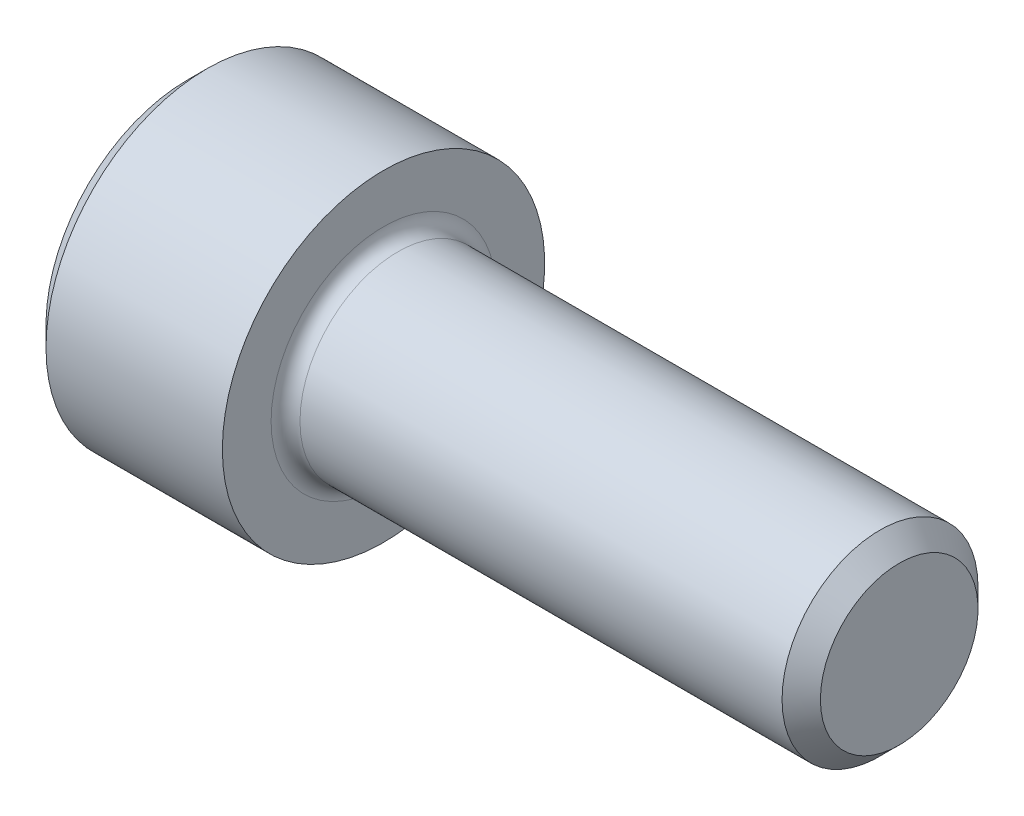
ISO-10303-21;
HEADER;
FILE_DESCRIPTION(('STEP AP214'),'2;1');
FILE_NAME('part.step','',(''),(''),'','','');
FILE_SCHEMA(('AUTOMOTIVE_DESIGN { 1 0 10303 214 1 1 1 1 }'));
ENDSEC;
DATA;
#1=APPLICATION_CONTEXT('core data for automotive mechanical design processes');
#2=APPLICATION_PROTOCOL_DEFINITION('international standard','automotive_design',2000,#1);
#3=PRODUCT_CONTEXT('',#1,'mechanical');
#4=PRODUCT('Part','Part','',(#3));
#5=PRODUCT_RELATED_PRODUCT_CATEGORY('part','',(#4));
#6=PRODUCT_DEFINITION_FORMATION('','',#4);
#7=PRODUCT_DEFINITION_CONTEXT('part definition',#1,'design');
#8=PRODUCT_DEFINITION('design','',#6,#7);
#9=PRODUCT_DEFINITION_SHAPE('','',#8);
#10=(LENGTH_UNIT() NAMED_UNIT(*) SI_UNIT(.MILLI.,.METRE.));
#11=(NAMED_UNIT(*) PLANE_ANGLE_UNIT() SI_UNIT($,.RADIAN.));
#12=(NAMED_UNIT(*) SI_UNIT($,.STERADIAN.) SOLID_ANGLE_UNIT());
#13=UNCERTAINTY_MEASURE_WITH_UNIT(LENGTH_MEASURE(1.E-05),#10,'distance_accuracy_value','');
#14=(GEOMETRIC_REPRESENTATION_CONTEXT(3) GLOBAL_UNCERTAINTY_ASSIGNED_CONTEXT((#13)) GLOBAL_UNIT_ASSIGNED_CONTEXT((#10,
#11,#12)) REPRESENTATION_CONTEXT('',''));
#15=CARTESIAN_POINT('',(0.,0.,0.));
#16=DIRECTION('',(0.,0.,1.));
#17=DIRECTION('',(1.,0.,0.));
#18=AXIS2_PLACEMENT_3D('',#15,#16,#17);
#19=CARTESIAN_POINT('',(2.286,1.14604605784411,1.98501));
#20=DIRECTION('',(-1.,0.,0.));
#21=DIRECTION('',(0.,0.,1.));
#22=AXIS2_PLACEMENT_3D('',#19,#20,#21);
#23=PLANE('',#22);
#24=DIRECTION('',(0.,0.500000000000001,0.866025403784438));
#25=VECTOR('',#24,1.);
#26=CARTESIAN_POINT('',(2.286,-1.71906908676614,0.992505));
#27=LINE('',#26,#25);
#28=CARTESIAN_POINT('',(2.2859999999804,-1.71906908679011,0.992505000013839));
#29=VERTEX_POINT('',#28);
#30=CARTESIAN_POINT('',(2.286,-1.14604605784409,1.98501));
#31=VERTEX_POINT('',#30);
#32=EDGE_CURVE('E123',#29,#31,#27,.T.);
#33=ORIENTED_EDGE('',*,*,#32,.T.);
#34=DIRECTION('',(0.,1.,0.));
#35=VECTOR('',#34,1.);
#36=CARTESIAN_POINT('',(2.286,1.14604605784411,1.98501));
#37=LINE('',#36,#35);
#38=CARTESIAN_POINT('',(2.28599999998701,0.,1.98501000001309));
#39=VERTEX_POINT('',#38);
#40=EDGE_CURVE('E118',#31,#39,#37,.T.);
#41=ORIENTED_EDGE('',*,*,#40,.T.);
#42=CARTESIAN_POINT('',(2.2859999999608,0.,0.));
#43=DIRECTION('',(-1.,0.,0.));
#44=DIRECTION('',(0.,0.,1.));
#45=AXIS2_PLACEMENT_3D('',#42,#43,#44);
#46=CIRCLE('',#45,1.98501000005535);
#47=EDGE_CURVE('E120',#39,#29,#46,.F.);
#48=ORIENTED_EDGE('',*,*,#47,.T.);
#49=EDGE_LOOP('',(#33,#41,#48));
#50=FACE_BOUND('',#49,.T.);
#51=ADVANCED_FACE('F16',(#50),#23,.T.);
#52=CARTESIAN_POINT('',(2.286,1.14604605784411,1.98501));
#53=DIRECTION('',(-1.,0.,0.));
#54=DIRECTION('',(0.,0.,1.));
#55=AXIS2_PLACEMENT_3D('',#52,#53,#54);
#56=PLANE('',#55);
#57=DIRECTION('',(0.,-0.499999999999998,0.86602540378444));
#58=VECTOR('',#57,1.);
#59=CARTESIAN_POINT('',(2.286,-1.71906908676615,-0.992504999999996));
#60=LINE('',#59,#58);
#61=CARTESIAN_POINT('',(2.2859999999804,-1.71906908679012,-0.992505000013836));
#62=VERTEX_POINT('',#61);
#63=CARTESIAN_POINT('',(2.286,-2.29209211568819,0.));
#64=VERTEX_POINT('',#63);
#65=EDGE_CURVE('E128',#62,#64,#60,.T.);
#66=ORIENTED_EDGE('',*,*,#65,.T.);
#67=DIRECTION('',(0.,0.500000000000001,0.866025403784438));
#68=VECTOR('',#67,1.);
#69=CARTESIAN_POINT('',(2.286,-2.29209211568819,0.));
#70=LINE('',#69,#68);
#71=EDGE_CURVE('E191',#64,#29,#70,.T.);
#72=ORIENTED_EDGE('',*,*,#71,.T.);
#73=CARTESIAN_POINT('',(2.2859999999608,0.,0.));
#74=DIRECTION('',(-1.,0.,0.));
#75=DIRECTION('',(0.,0.,1.));
#76=AXIS2_PLACEMENT_3D('',#73,#74,#75);
#77=CIRCLE('',#76,1.98501000005535);
#78=EDGE_CURVE('E140',#29,#62,#77,.F.);
#79=ORIENTED_EDGE('',*,*,#78,.T.);
#80=EDGE_LOOP('',(#66,#72,#79));
#81=FACE_BOUND('',#80,.T.);
#82=ADVANCED_FACE('F367',(#81),#56,.T.);
#83=CARTESIAN_POINT('',(2.286,1.14604605784411,1.98501));
#84=DIRECTION('',(-1.,0.,0.));
#85=DIRECTION('',(0.,0.,1.));
#86=AXIS2_PLACEMENT_3D('',#83,#84,#85);
#87=PLANE('',#86);
#88=DIRECTION('',(0.,1.,0.));
#89=VECTOR('',#88,1.);
#90=CARTESIAN_POINT('',(2.286,1.14604605784411,-1.98501));
#91=LINE('',#90,#89);
#92=CARTESIAN_POINT('',(2.28599999998701,0.,-1.98501000001309));
#93=VERTEX_POINT('',#92);
#94=CARTESIAN_POINT('',(2.286,-1.1460460578441,-1.98501));
#95=VERTEX_POINT('',#94);
#96=EDGE_CURVE('E187',#93,#95,#91,.F.);
#97=ORIENTED_EDGE('',*,*,#96,.T.);
#98=DIRECTION('',(0.,-0.499999999999999,0.866025403784439));
#99=VECTOR('',#98,1.);
#100=CARTESIAN_POINT('',(2.286,-1.1460460578441,-1.98501));
#101=LINE('',#100,#99);
#102=EDGE_CURVE('E183',#95,#62,#101,.T.);
#103=ORIENTED_EDGE('',*,*,#102,.T.);
#104=CARTESIAN_POINT('',(2.2859999999608,0.,0.));
#105=DIRECTION('',(-1.,0.,0.));
#106=DIRECTION('',(0.,0.,1.));
#107=AXIS2_PLACEMENT_3D('',#104,#105,#106);
#108=CIRCLE('',#107,1.98501000005535);
#109=EDGE_CURVE('E237',#62,#93,#108,.F.);
#110=ORIENTED_EDGE('',*,*,#109,.T.);
#111=EDGE_LOOP('',(#97,#103,#110));
#112=FACE_BOUND('',#111,.T.);
#113=ADVANCED_FACE('F364',(#112),#87,.T.);
#114=CARTESIAN_POINT('',(2.286,1.14604605784411,1.98501));
#115=DIRECTION('',(-1.,0.,0.));
#116=DIRECTION('',(0.,0.,1.));
#117=AXIS2_PLACEMENT_3D('',#114,#115,#116);
#118=PLANE('',#117);
#119=DIRECTION('',(0.,-0.500000000000001,-0.866025403784438));
#120=VECTOR('',#119,1.);
#121=CARTESIAN_POINT('',(2.286,1.71906908676615,-0.992505000000006));
#122=LINE('',#121,#120);
#123=CARTESIAN_POINT('',(2.2859999999804,1.71906908679012,-0.992505000013843));
#124=VERTEX_POINT('',#123);
#125=CARTESIAN_POINT('',(2.286,1.1460460578441,-1.98501));
#126=VERTEX_POINT('',#125);
#127=EDGE_CURVE('E180',#124,#126,#122,.T.);
#128=ORIENTED_EDGE('',*,*,#127,.T.);
#129=DIRECTION('',(0.,1.,0.));
#130=VECTOR('',#129,1.);
#131=CARTESIAN_POINT('',(2.286,1.14604605784411,-1.98501));
#132=LINE('',#131,#130);
#133=EDGE_CURVE('E176',#126,#93,#132,.F.);
#134=ORIENTED_EDGE('',*,*,#133,.T.);
#135=CARTESIAN_POINT('',(2.2859999999608,0.,0.));
#136=DIRECTION('',(-1.,0.,0.));
#137=DIRECTION('',(0.,0.,1.));
#138=AXIS2_PLACEMENT_3D('',#135,#136,#137);
#139=CIRCLE('',#138,1.98501000005535);
#140=EDGE_CURVE('E233',#93,#124,#139,.F.);
#141=ORIENTED_EDGE('',*,*,#140,.T.);
#142=EDGE_LOOP('',(#128,#134,#141));
#143=FACE_BOUND('',#142,.T.);
#144=ADVANCED_FACE('F360',(#143),#118,.T.);
#145=CARTESIAN_POINT('',(2.286,1.14604605784411,1.98501));
#146=DIRECTION('',(-1.,0.,0.));
#147=DIRECTION('',(0.,0.,1.));
#148=AXIS2_PLACEMENT_3D('',#145,#146,#147);
#149=PLANE('',#148);
#150=DIRECTION('',(0.,0.500000000000002,-0.866025403784437));
#151=VECTOR('',#150,1.);
#152=CARTESIAN_POINT('',(2.286,1.71906908676615,0.992504999999996));
#153=LINE('',#152,#151);
#154=CARTESIAN_POINT('',(2.2859999999804,1.71906908679012,0.992505000013835));
#155=VERTEX_POINT('',#154);
#156=CARTESIAN_POINT('',(2.286,2.2920921156882,0.));
#157=VERTEX_POINT('',#156);
#158=EDGE_CURVE('E172',#155,#157,#153,.T.);
#159=ORIENTED_EDGE('',*,*,#158,.T.);
#160=DIRECTION('',(0.,-0.500000000000002,-0.866025403784437));
#161=VECTOR('',#160,1.);
#162=CARTESIAN_POINT('',(2.286,2.2920921156882,0.));
#163=LINE('',#162,#161);
#164=EDGE_CURVE('E142',#157,#124,#163,.T.);
#165=ORIENTED_EDGE('',*,*,#164,.T.);
#166=CARTESIAN_POINT('',(2.2859999999608,0.,0.));
#167=DIRECTION('',(-1.,0.,0.));
#168=DIRECTION('',(0.,0.,1.));
#169=AXIS2_PLACEMENT_3D('',#166,#167,#168);
#170=CIRCLE('',#169,1.98501000005535);
#171=EDGE_CURVE('E150',#124,#155,#170,.F.);
#172=ORIENTED_EDGE('',*,*,#171,.T.);
#173=EDGE_LOOP('',(#159,#165,#172));
#174=FACE_BOUND('',#173,.T.);
#175=ADVANCED_FACE('F356',(#174),#149,.T.);
#176=CARTESIAN_POINT('',(2.28600000002643,0.,0.));
#177=DIRECTION('',(-1.,0.,0.));
#178=DIRECTION('',(0.,0.,1.));
#179=AXIS2_PLACEMENT_3D('',#176,#177,#178);
#180=CONICAL_SURFACE('',#179,1.98500999994167,1.04719755112655);
#181=CARTESIAN_POINT('',(3.43204605781011,0.,5.6843418860808E-11));
#182=VERTEX_POINT('',#181);
#183=VERTEX_LOOP('',#182);
#184=FACE_BOUND('',#183,.T.);
#185=ORIENTED_EDGE('',*,*,#47,.F.);
#186=CARTESIAN_POINT('',(2.2859999999608,0.,0.));
#187=DIRECTION('',(-1.,0.,0.));
#188=DIRECTION('',(0.,0.,1.));
#189=AXIS2_PLACEMENT_3D('',#186,#187,#188);
#190=CIRCLE('',#189,1.98501000005535);
#191=EDGE_CURVE('E136',#155,#39,#190,.F.);
#192=ORIENTED_EDGE('',*,*,#191,.F.);
#193=ORIENTED_EDGE('',*,*,#171,.F.);
#194=ORIENTED_EDGE('',*,*,#140,.F.);
#195=ORIENTED_EDGE('',*,*,#109,.F.);
#196=ORIENTED_EDGE('',*,*,#78,.F.);
#197=EDGE_LOOP('',(#185,#192,#193,#194,#195,#196));
#198=FACE_BOUND('',#197,.T.);
#199=ADVANCED_FACE('F134',(#184,#198),#180,.F.);
#200=CARTESIAN_POINT('',(2.286,1.14604605784411,1.98501));
#201=DIRECTION('',(-1.,0.,0.));
#202=DIRECTION('',(0.,0.,1.));
#203=AXIS2_PLACEMENT_3D('',#200,#201,#202);
#204=PLANE('',#203);
#205=DIRECTION('',(0.,-1.,0.));
#206=VECTOR('',#205,1.);
#207=CARTESIAN_POINT('',(2.286,-1.14604605784409,1.98501));
#208=LINE('',#207,#206);
#209=CARTESIAN_POINT('',(2.286,1.14604605784411,1.98501));
#210=VERTEX_POINT('',#209);
#211=EDGE_CURVE('E146',#39,#210,#208,.F.);
#212=ORIENTED_EDGE('',*,*,#211,.T.);
#213=DIRECTION('',(0.,0.499999999999998,-0.86602540378444));
#214=VECTOR('',#213,1.);
#215=CARTESIAN_POINT('',(2.286,2.2920921156882,0.));
#216=LINE('',#215,#214);
#217=EDGE_CURVE('E148',#155,#210,#216,.F.);
#218=ORIENTED_EDGE('',*,*,#217,.F.);
#219=ORIENTED_EDGE('',*,*,#191,.T.);
#220=EDGE_LOOP('',(#212,#218,#219));
#221=FACE_BOUND('',#220,.T.);
#222=ADVANCED_FACE('F145',(#221),#204,.T.);
#223=CARTESIAN_POINT('',(2.286,2.2920921156882,0.));
#224=DIRECTION('',(0.,-0.86602540378444,-0.499999999999998));
#225=DIRECTION('',(0.,0.499999999999998,-0.86602540378444));
#226=AXIS2_PLACEMENT_3D('',#223,#224,#225);
#227=PLANE('',#226);
#228=ORIENTED_EDGE('',*,*,#217,.T.);
#229=DIRECTION('',(1.,0.,0.));
#230=VECTOR('',#229,1.);
#231=CARTESIAN_POINT('',(2.286,1.14604605784411,1.98501));
#232=LINE('',#231,#230);
#233=CARTESIAN_POINT('',(0.,1.14604605784411,1.98501));
#234=VERTEX_POINT('',#233);
#235=EDGE_CURVE('E155',#210,#234,#232,.F.);
#236=ORIENTED_EDGE('',*,*,#235,.T.);
#237=DIRECTION('',(0.,-0.499999999999998,0.86602540378444));
#238=VECTOR('',#237,1.);
#239=CARTESIAN_POINT('',(0.,2.2920921156882,0.));
#240=LINE('',#239,#238);
#241=CARTESIAN_POINT('',(0.,2.2920921156882,0.));
#242=VERTEX_POINT('',#241);
#243=EDGE_CURVE('E166',#242,#234,#240,.T.);
#244=ORIENTED_EDGE('',*,*,#243,.F.);
#245=DIRECTION('',(1.,0.,0.));
#246=VECTOR('',#245,1.);
#247=CARTESIAN_POINT('',(2.286,2.2920921156882,0.));
#248=LINE('',#247,#246);
#249=EDGE_CURVE('E199',#242,#157,#248,.T.);
#250=ORIENTED_EDGE('',*,*,#249,.T.);
#251=ORIENTED_EDGE('',*,*,#158,.F.);
#252=EDGE_LOOP('',(#228,#236,#244,#250,#251));
#253=FACE_BOUND('',#252,.T.);
#254=ADVANCED_FACE('F348',(#253),#227,.T.);
#255=CARTESIAN_POINT('',(2.286,-1.14604605784409,1.98501));
#256=DIRECTION('',(0.,0.,1.));
#257=DIRECTION('',(0.,-1.,0.));
#258=AXIS2_PLACEMENT_3D('',#255,#256,#257);
#259=PLANE('',#258);
#260=ORIENTED_EDGE('',*,*,#235,.F.);
#261=ORIENTED_EDGE('',*,*,#211,.F.);
#262=ORIENTED_EDGE('',*,*,#40,.F.);
#263=DIRECTION('',(1.,0.,0.));
#264=VECTOR('',#263,1.);
#265=CARTESIAN_POINT('',(2.286,-1.14604605784409,1.98501));
#266=LINE('',#265,#264);
#267=CARTESIAN_POINT('',(0.,-1.14604605784409,1.98501));
#268=VERTEX_POINT('',#267);
#269=EDGE_CURVE('E161',#268,#31,#266,.T.);
#270=ORIENTED_EDGE('',*,*,#269,.F.);
#271=DIRECTION('',(0.,1.,0.));
#272=VECTOR('',#271,1.);
#273=CARTESIAN_POINT('',(0.,0.,1.98501));
#274=LINE('',#273,#272);
#275=EDGE_CURVE('E250',#234,#268,#274,.F.);
#276=ORIENTED_EDGE('',*,*,#275,.F.);
#277=EDGE_LOOP('',(#260,#261,#262,#270,#276));
#278=FACE_BOUND('',#277,.T.);
#279=ADVANCED_FACE('F153',(#278),#259,.F.);
#280=CARTESIAN_POINT('',(2.286,-1.14604605784409,1.98501));
#281=DIRECTION('',(0.,0.866025403784438,-0.500000000000001));
#282=DIRECTION('',(0.,0.500000000000001,0.866025403784438));
#283=AXIS2_PLACEMENT_3D('',#280,#281,#282);
#284=PLANE('',#283);
#285=ORIENTED_EDGE('',*,*,#71,.F.);
#286=DIRECTION('',(1.,0.,0.));
#287=VECTOR('',#286,1.);
#288=CARTESIAN_POINT('',(2.286,-2.29209211568819,0.));
#289=LINE('',#288,#287);
#290=CARTESIAN_POINT('',(0.,-2.29209211568819,0.));
#291=VERTEX_POINT('',#290);
#292=EDGE_CURVE('E209',#291,#64,#289,.T.);
#293=ORIENTED_EDGE('',*,*,#292,.F.);
#294=DIRECTION('',(0.,-0.500000000000001,-0.866025403784438));
#295=VECTOR('',#294,1.);
#296=CARTESIAN_POINT('',(0.,-1.14604605784409,1.98501));
#297=LINE('',#296,#295);
#298=EDGE_CURVE('E253',#268,#291,#297,.T.);
#299=ORIENTED_EDGE('',*,*,#298,.F.);
#300=ORIENTED_EDGE('',*,*,#269,.T.);
#301=ORIENTED_EDGE('',*,*,#32,.F.);
#302=EDGE_LOOP('',(#285,#293,#299,#300,#301));
#303=FACE_BOUND('',#302,.T.);
#304=ADVANCED_FACE('F341',(#303),#284,.T.);
#305=CARTESIAN_POINT('',(2.286,-2.29209211568819,0.));
#306=DIRECTION('',(0.,0.866025403784439,0.499999999999999));
#307=DIRECTION('',(0.,-0.499999999999999,0.866025403784439));
#308=AXIS2_PLACEMENT_3D('',#305,#306,#307);
#309=PLANE('',#308);
#310=ORIENTED_EDGE('',*,*,#102,.F.);
#311=DIRECTION('',(1.,0.,0.));
#312=VECTOR('',#311,1.);
#313=CARTESIAN_POINT('',(2.286,-1.1460460578441,-1.98501));
#314=LINE('',#313,#312);
#315=CARTESIAN_POINT('',(0.,-1.1460460578441,-1.98501));
#316=VERTEX_POINT('',#315);
#317=EDGE_CURVE('E204',#95,#316,#314,.F.);
#318=ORIENTED_EDGE('',*,*,#317,.T.);
#319=DIRECTION('',(0.,0.499999999999999,-0.86602540378444));
#320=VECTOR('',#319,1.);
#321=CARTESIAN_POINT('',(0.,-2.29209211568819,0.));
#322=LINE('',#321,#320);
#323=EDGE_CURVE('E255',#291,#316,#322,.T.);
#324=ORIENTED_EDGE('',*,*,#323,.F.);
#325=ORIENTED_EDGE('',*,*,#292,.T.);
#326=ORIENTED_EDGE('',*,*,#65,.F.);
#327=EDGE_LOOP('',(#310,#318,#324,#325,#326));
#328=FACE_BOUND('',#327,.T.);
#329=ADVANCED_FACE('F337',(#328),#309,.T.);
#330=CARTESIAN_POINT('',(2.286,1.1460460578441,-1.98501));
#331=DIRECTION('',(0.,0.,-1.));
#332=DIRECTION('',(0.,1.,0.));
#333=AXIS2_PLACEMENT_3D('',#330,#331,#332);
#334=PLANE('',#333);
#335=ORIENTED_EDGE('',*,*,#317,.F.);
#336=ORIENTED_EDGE('',*,*,#96,.F.);
#337=ORIENTED_EDGE('',*,*,#133,.F.);
#338=DIRECTION('',(1.,0.,0.));
#339=VECTOR('',#338,1.);
#340=CARTESIAN_POINT('',(2.286,1.1460460578441,-1.98501));
#341=LINE('',#340,#339);
#342=CARTESIAN_POINT('',(0.,1.1460460578441,-1.98501));
#343=VERTEX_POINT('',#342);
#344=EDGE_CURVE('E203',#126,#343,#341,.F.);
#345=ORIENTED_EDGE('',*,*,#344,.T.);
#346=DIRECTION('',(0.,1.,0.));
#347=VECTOR('',#346,1.);
#348=CARTESIAN_POINT('',(0.,0.,-1.98501));
#349=LINE('',#348,#347);
#350=EDGE_CURVE('E261',#316,#343,#349,.T.);
#351=ORIENTED_EDGE('',*,*,#350,.F.);
#352=EDGE_LOOP('',(#335,#336,#337,#345,#351));
#353=FACE_BOUND('',#352,.T.);
#354=ADVANCED_FACE('F333',(#353),#334,.F.);
#355=CARTESIAN_POINT('',(2.286,2.2920921156882,0.));
#356=DIRECTION('',(0.,0.866025403784438,-0.500000000000002));
#357=DIRECTION('',(0.,0.500000000000002,0.866025403784438));
#358=AXIS2_PLACEMENT_3D('',#355,#356,#357);
#359=PLANE('',#358);
#360=ORIENTED_EDGE('',*,*,#344,.F.);
#361=ORIENTED_EDGE('',*,*,#127,.F.);
#362=ORIENTED_EDGE('',*,*,#164,.F.);
#363=ORIENTED_EDGE('',*,*,#249,.F.);
#364=DIRECTION('',(0.,0.500000000000002,0.866025403784438));
#365=VECTOR('',#364,1.);
#366=CARTESIAN_POINT('',(0.,1.1460460578441,-1.98501));
#367=LINE('',#366,#365);
#368=EDGE_CURVE('E228',#343,#242,#367,.T.);
#369=ORIENTED_EDGE('',*,*,#368,.F.);
#370=EDGE_LOOP('',(#360,#361,#362,#363,#369));
#371=FACE_BOUND('',#370,.T.);
#372=ADVANCED_FACE('F329',(#371),#359,.F.);
#373=CARTESIAN_POINT('',(0.,0.,0.));
#374=DIRECTION('',(-1.,0.,0.));
#375=DIRECTION('',(0.,0.,1.));
#376=AXIS2_PLACEMENT_3D('',#373,#374,#375);
#377=PLANE('',#376);
#378=CARTESIAN_POINT('',(-5.6843418860808E-11,0.,0.));
#379=DIRECTION('',(1.,0.,0.));
#380=DIRECTION('',(0.,1.,0.));
#381=AXIS2_PLACEMENT_3D('',#378,#379,#380);
#382=CIRCLE('',#381,3.48615000001473);
#383=CARTESIAN_POINT('',(-5.68434426698877E-11,3.48615000001473,0.));
#384=VERTEX_POINT('',#383);
#385=EDGE_CURVE('E225',#384,#384,#382,.T.);
#386=ORIENTED_EDGE('',*,*,#385,.F.);
#387=EDGE_LOOP('',(#386));
#388=FACE_BOUND('',#387,.T.);
#389=ORIENTED_EDGE('',*,*,#350,.T.);
#390=ORIENTED_EDGE('',*,*,#368,.T.);
#391=ORIENTED_EDGE('',*,*,#243,.T.);
#392=ORIENTED_EDGE('',*,*,#275,.T.);
#393=ORIENTED_EDGE('',*,*,#298,.T.);
#394=ORIENTED_EDGE('',*,*,#323,.T.);
#395=EDGE_LOOP('',(#389,#390,#391,#392,#393,#394));
#396=FACE_BOUND('',#395,.T.);
#397=ADVANCED_FACE('F325',(#388,#396),#377,.T.);
#398=CARTESIAN_POINT('',(0.482599999998001,0.,0.));
#399=DIRECTION('',(1.,0.,0.));
#400=DIRECTION('',(0.,1.,0.));
#401=AXIS2_PLACEMENT_3D('',#398,#399,#400);
#402=CONICAL_SURFACE('',#401,3.96875000006958,0.785398163397448);
#403=ORIENTED_EDGE('',*,*,#385,.T.);
#404=EDGE_LOOP('',(#403));
#405=FACE_BOUND('',#404,.T.);
#406=CARTESIAN_POINT('',(0.4826,0.,0.));
#407=DIRECTION('',(-1.,0.,0.));
#408=DIRECTION('',(0.,0.,1.));
#409=AXIS2_PLACEMENT_3D('',#406,#407,#408);
#410=CIRCLE('',#409,3.96875);
#411=CARTESIAN_POINT('',(0.4826,0.,3.96875));
#412=VERTEX_POINT('',#411);
#413=EDGE_CURVE('E224',#412,#412,#410,.F.);
#414=ORIENTED_EDGE('',*,*,#413,.F.);
#415=EDGE_LOOP('',(#414));
#416=FACE_BOUND('',#415,.T.);
#417=ADVANCED_FACE('F321',(#405,#416),#402,.T.);
#418=CARTESIAN_POINT('',(-31.75,0.,0.));
#419=DIRECTION('',(-1.,0.,0.));
#420=DIRECTION('',(0.,0.,1.));
#421=AXIS2_PLACEMENT_3D('',#418,#419,#420);
#422=CYLINDRICAL_SURFACE('',#421,3.96875);
#423=CARTESIAN_POINT('',(4.826,0.,0.));
#424=DIRECTION('',(-1.,0.,0.));
#425=DIRECTION('',(0.,0.,1.));
#426=AXIS2_PLACEMENT_3D('',#423,#424,#425);
#427=CIRCLE('',#426,3.96875);
#428=CARTESIAN_POINT('',(4.826,0.,3.96875));
#429=VERTEX_POINT('',#428);
#430=EDGE_CURVE('E220',#429,#429,#427,.F.);
#431=ORIENTED_EDGE('',*,*,#430,.F.);
#432=EDGE_LOOP('',(#431));
#433=FACE_BOUND('',#432,.T.);
#434=ORIENTED_EDGE('',*,*,#413,.T.);
#435=EDGE_LOOP('',(#434));
#436=FACE_BOUND('',#435,.T.);
#437=ADVANCED_FACE('F317',(#433,#436),#422,.T.);
#438=CARTESIAN_POINT('',(17.526,1.94056,0.));
#439=DIRECTION('',(1.,0.,0.));
#440=DIRECTION('',(0.,0.,-1.));
#441=AXIS2_PLACEMENT_3D('',#438,#439,#440);
#442=PLANE('',#441);
#443=CARTESIAN_POINT('',(17.5259999999753,0.,0.));
#444=DIRECTION('',(-1.,0.,0.));
#445=DIRECTION('',(0.,0.,1.));
#446=AXIS2_PLACEMENT_3D('',#443,#444,#445);
#447=CIRCLE('',#446,1.94055999998);
#448=CARTESIAN_POINT('',(17.5259999999753,0.,1.94055999998));
#449=VERTEX_POINT('',#448);
#450=EDGE_CURVE('E215',#449,#449,#447,.T.);
#451=ORIENTED_EDGE('',*,*,#450,.F.);
#452=EDGE_LOOP('',(#451));
#453=FACE_BOUND('',#452,.T.);
#454=ADVANCED_FACE('F305',(#453),#442,.T.);
#455=CARTESIAN_POINT('',(4.826,3.96875,0.));
#456=DIRECTION('',(1.,0.,0.));
#457=DIRECTION('',(0.,0.,-1.));
#458=AXIS2_PLACEMENT_3D('',#455,#456,#457);
#459=PLANE('',#458);
#460=ORIENTED_EDGE('',*,*,#430,.T.);
#461=EDGE_LOOP('',(#460));
#462=FACE_BOUND('',#461,.T.);
#463=CARTESIAN_POINT('',(4.826,0.,0.));
#464=DIRECTION('',(1.,0.,0.));
#465=DIRECTION('',(0.,0.,1.));
#466=AXIS2_PLACEMENT_3D('',#463,#464,#465);
#467=CIRCLE('',#466,2.76859999999999);
#468=CARTESIAN_POINT('',(4.826,0.,-2.76859999999999));
#469=VERTEX_POINT('',#468);
#470=CARTESIAN_POINT('',(4.826,0.,2.76859999999999));
#471=VERTEX_POINT('',#470);
#472=EDGE_CURVE('E219',#469,#471,#467,.F.);
#473=ORIENTED_EDGE('',*,*,#472,.T.);
#474=CARTESIAN_POINT('',(4.826,0.,0.));
#475=DIRECTION('',(1.,0.,0.));
#476=DIRECTION('',(0.,0.,-1.));
#477=AXIS2_PLACEMENT_3D('',#474,#475,#476);
#478=CIRCLE('',#477,2.76859999999999);
#479=EDGE_CURVE('E40',#471,#469,#478,.F.);
#480=ORIENTED_EDGE('',*,*,#479,.T.);
#481=EDGE_LOOP('',(#473,#480));
#482=FACE_BOUND('',#481,.T.);
#483=ADVANCED_FACE('F296',(#462,#482),#459,.T.);
#484=CARTESIAN_POINT('',(17.0535599999084,0.,0.));
#485=DIRECTION('',(-1.,0.,0.));
#486=DIRECTION('',(0.,0.,1.));
#487=AXIS2_PLACEMENT_3D('',#484,#485,#486);
#488=CONICAL_SURFACE('',#487,2.41299999999001,0.785398163337289);
#489=CARTESIAN_POINT('',(17.05356,0.,0.));
#490=DIRECTION('',(-1.,0.,0.));
#491=DIRECTION('',(0.,0.,1.));
#492=AXIS2_PLACEMENT_3D('',#489,#490,#491);
#493=CIRCLE('',#492,2.41299999999999);
#494=CARTESIAN_POINT('',(17.05356,0.,2.41299999999999));
#495=VERTEX_POINT('',#494);
#496=EDGE_CURVE('E28',#495,#495,#493,.T.);
#497=ORIENTED_EDGE('',*,*,#496,.F.);
#498=EDGE_LOOP('',(#497));
#499=FACE_BOUND('',#498,.T.);
#500=ORIENTED_EDGE('',*,*,#450,.T.);
#501=EDGE_LOOP('',(#500));
#502=FACE_BOUND('',#501,.T.);
#503=ADVANCED_FACE('F287',(#499,#502),#488,.T.);
#504=CARTESIAN_POINT('',(5.1816,0.,0.));
#505=DIRECTION('',(1.,0.,0.));
#506=DIRECTION('',(0.,0.,-1.));
#507=AXIS2_PLACEMENT_3D('',#504,#505,#506);
#508=TOROIDAL_SURFACE('',#507,2.76859999999999,0.3556);
#509=CARTESIAN_POINT('',(5.1816,0.,0.));
#510=DIRECTION('',(-1.,0.,0.));
#511=DIRECTION('',(0.,0.,1.));
#512=AXIS2_PLACEMENT_3D('',#509,#510,#511);
#513=CIRCLE('',#512,2.41299999999999);
#514=CARTESIAN_POINT('',(5.1816,0.,2.41299999999999));
#515=VERTEX_POINT('',#514);
#516=EDGE_CURVE('E11',#515,#515,#513,.F.);
#517=ORIENTED_EDGE('',*,*,#516,.F.);
#518=EDGE_LOOP('',(#517));
#519=FACE_BOUND('',#518,.T.);
#520=ORIENTED_EDGE('',*,*,#472,.F.);
#521=ORIENTED_EDGE('',*,*,#479,.F.);
#522=EDGE_LOOP('',(#520,#521));
#523=FACE_BOUND('',#522,.T.);
#524=ADVANCED_FACE('F243',(#519,#523),#508,.F.);
#525=CARTESIAN_POINT('',(-31.75,0.,0.));
#526=DIRECTION('',(-1.,0.,0.));
#527=DIRECTION('',(0.,0.,1.));
#528=AXIS2_PLACEMENT_3D('',#525,#526,#527);
#529=CYLINDRICAL_SURFACE('',#528,2.41299999999999);
#530=ORIENTED_EDGE('',*,*,#516,.T.);
#531=EDGE_LOOP('',(#530));
#532=FACE_BOUND('',#531,.T.);
#533=ORIENTED_EDGE('',*,*,#496,.T.);
#534=EDGE_LOOP('',(#533));
#535=FACE_BOUND('',#534,.T.);
#536=ADVANCED_FACE('F286',(#532,#535),#529,.T.);
#537=CLOSED_SHELL('',(#51,#82,#113,#144,#175,#199,#222,#254,#279,#304,#329,#354,#372,#397,#417,
#437,#454,#483,#503,#524,#536));
#538=MANIFOLD_SOLID_BREP('B1',#537);
#539=ADVANCED_BREP_SHAPE_REPRESENTATION('',(#18,#538),#14);
#540=SHAPE_DEFINITION_REPRESENTATION(#9,#539);
ENDSEC;
END-ISO-10303-21;
